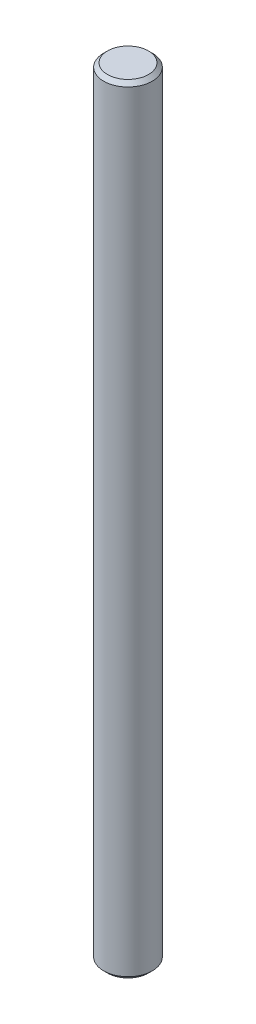
ISO-10303-21;
HEADER;
FILE_DESCRIPTION(('STEP AP214'),'2;1');
FILE_NAME('part.step','',(''),(''),'','','');
FILE_SCHEMA(('AUTOMOTIVE_DESIGN { 1 0 10303 214 1 1 1 1 }'));
ENDSEC;
DATA;
#1=APPLICATION_CONTEXT('core data for automotive mechanical design processes');
#2=APPLICATION_PROTOCOL_DEFINITION('international standard','automotive_design',2000,#1);
#3=PRODUCT_CONTEXT('',#1,'mechanical');
#4=PRODUCT('Part','Part','',(#3));
#5=PRODUCT_RELATED_PRODUCT_CATEGORY('part','',(#4));
#6=PRODUCT_DEFINITION_FORMATION('','',#4);
#7=PRODUCT_DEFINITION_CONTEXT('part definition',#1,'design');
#8=PRODUCT_DEFINITION('design','',#6,#7);
#9=PRODUCT_DEFINITION_SHAPE('','',#8);
#10=(LENGTH_UNIT() NAMED_UNIT(*) SI_UNIT(.MILLI.,.METRE.));
#11=(NAMED_UNIT(*) PLANE_ANGLE_UNIT() SI_UNIT($,.RADIAN.));
#12=(NAMED_UNIT(*) SI_UNIT($,.STERADIAN.) SOLID_ANGLE_UNIT());
#13=UNCERTAINTY_MEASURE_WITH_UNIT(LENGTH_MEASURE(1.E-05),#10,'distance_accuracy_value','');
#14=(GEOMETRIC_REPRESENTATION_CONTEXT(3) GLOBAL_UNCERTAINTY_ASSIGNED_CONTEXT((#13)) GLOBAL_UNIT_ASSIGNED_CONTEXT((#10,
#11,#12)) REPRESENTATION_CONTEXT('',''));
#15=CARTESIAN_POINT('',(0.,0.,0.));
#16=DIRECTION('',(0.,0.,1.));
#17=DIRECTION('',(1.,0.,0.));
#18=AXIS2_PLACEMENT_3D('',#15,#16,#17);
#19=CARTESIAN_POINT('',(0.,101.6,0.));
#20=DIRECTION('',(0.,-1.,0.));
#21=DIRECTION('',(0.,0.,-1.));
#22=AXIS2_PLACEMENT_3D('',#19,#20,#21);
#23=CYLINDRICAL_SURFACE('',#22,3.175);
#24=CARTESIAN_POINT('',(0.,0.500000000000028,0.));
#25=DIRECTION('',(0.,1.,0.));
#26=DIRECTION('',(0.,0.,1.));
#27=AXIS2_PLACEMENT_3D('',#24,#25,#26);
#28=CIRCLE('',#27,3.175);
#29=CARTESIAN_POINT('',(0.,0.500000000000028,3.175));
#30=VERTEX_POINT('',#29);
#31=EDGE_CURVE('E41',#30,#30,#28,.T.);
#32=ORIENTED_EDGE('',*,*,#31,.T.);
#33=EDGE_LOOP('',(#32));
#34=FACE_BOUND('',#33,.T.);
#35=CARTESIAN_POINT('',(0.,101.1,0.));
#36=DIRECTION('',(0.,1.,0.));
#37=DIRECTION('',(0.,0.,1.));
#38=AXIS2_PLACEMENT_3D('',#35,#36,#37);
#39=CIRCLE('',#38,3.175);
#40=CARTESIAN_POINT('',(0.,101.1,3.175));
#41=VERTEX_POINT('',#40);
#42=EDGE_CURVE('E45',#41,#41,#39,.F.);
#43=ORIENTED_EDGE('',*,*,#42,.T.);
#44=EDGE_LOOP('',(#43));
#45=FACE_BOUND('',#44,.T.);
#46=ADVANCED_FACE('F30',(#34,#45),#23,.T.);
#47=CARTESIAN_POINT('',(0.,101.6,0.));
#48=DIRECTION('',(0.,1.,0.));
#49=DIRECTION('',(0.,0.,1.));
#50=AXIS2_PLACEMENT_3D('',#47,#48,#49);
#51=PLANE('',#50);
#52=CARTESIAN_POINT('',(0.,101.6,0.));
#53=DIRECTION('',(0.,1.,0.));
#54=DIRECTION('',(0.,0.,1.));
#55=AXIS2_PLACEMENT_3D('',#52,#53,#54);
#56=CIRCLE('',#55,2.67499999999998);
#57=CARTESIAN_POINT('',(0.,101.6,2.67499999999998));
#58=VERTEX_POINT('',#57);
#59=EDGE_CURVE('E10',#58,#58,#56,.T.);
#60=ORIENTED_EDGE('',*,*,#59,.T.);
#61=EDGE_LOOP('',(#60));
#62=FACE_BOUND('',#61,.T.);
#63=ADVANCED_FACE('F61',(#62),#51,.T.);
#64=CARTESIAN_POINT('',(0.,0.,0.));
#65=DIRECTION('',(0.,1.,0.));
#66=DIRECTION('',(0.,0.,1.));
#67=AXIS2_PLACEMENT_3D('',#64,#65,#66);
#68=PLANE('',#67);
#69=CARTESIAN_POINT('',(0.,0.,0.));
#70=DIRECTION('',(0.,1.,0.));
#71=DIRECTION('',(0.,0.,1.));
#72=AXIS2_PLACEMENT_3D('',#69,#70,#71);
#73=CIRCLE('',#72,2.67499999999997);
#74=CARTESIAN_POINT('',(0.,0.,2.67499999999997));
#75=VERTEX_POINT('',#74);
#76=EDGE_CURVE('E37',#75,#75,#73,.F.);
#77=ORIENTED_EDGE('',*,*,#76,.T.);
#78=EDGE_LOOP('',(#77));
#79=FACE_BOUND('',#78,.T.);
#80=ADVANCED_FACE('F58',(#79),#68,.F.);
#81=CARTESIAN_POINT('',(0.,0.500000000000028,0.));
#82=DIRECTION('',(0.,1.,0.));
#83=DIRECTION('',(0.,0.,1.));
#84=AXIS2_PLACEMENT_3D('',#81,#82,#83);
#85=CONICAL_SURFACE('',#84,3.175,0.785398163397451);
#86=ORIENTED_EDGE('',*,*,#76,.F.);
#87=EDGE_LOOP('',(#86));
#88=FACE_BOUND('',#87,.T.);
#89=ORIENTED_EDGE('',*,*,#31,.F.);
#90=EDGE_LOOP('',(#89));
#91=FACE_BOUND('',#90,.T.);
#92=ADVANCED_FACE('F54',(#88,#91),#85,.T.);
#93=CARTESIAN_POINT('',(0.,101.6,0.));
#94=DIRECTION('',(0.,-1.,0.));
#95=DIRECTION('',(0.,0.,-1.));
#96=AXIS2_PLACEMENT_3D('',#93,#94,#95);
#97=CONICAL_SURFACE('',#96,2.67499999999998,0.785398163397451);
#98=ORIENTED_EDGE('',*,*,#42,.F.);
#99=EDGE_LOOP('',(#98));
#100=FACE_BOUND('',#99,.T.);
#101=ORIENTED_EDGE('',*,*,#59,.F.);
#102=EDGE_LOOP('',(#101));
#103=FACE_BOUND('',#102,.T.);
#104=ADVANCED_FACE('F32',(#100,#103),#97,.T.);
#105=CLOSED_SHELL('',(#46,#63,#80,#92,#104));
#106=MANIFOLD_SOLID_BREP('B2',#105);
#107=ADVANCED_BREP_SHAPE_REPRESENTATION('',(#18,#106),#14);
#108=SHAPE_DEFINITION_REPRESENTATION(#9,#107);
ENDSEC;
END-ISO-10303-21;
